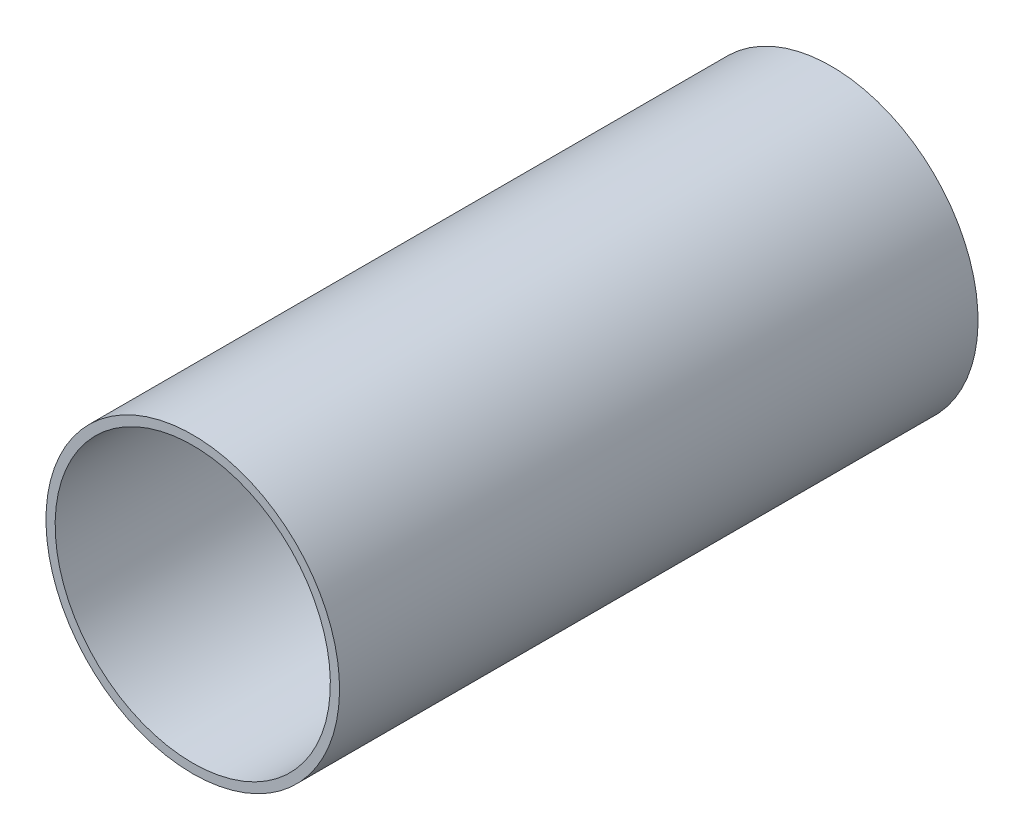
ISO-10303-21;
HEADER;
FILE_DESCRIPTION(('STEP AP214'),'2;1');
FILE_NAME('part.step','',(''),(''),'','','');
FILE_SCHEMA(('AUTOMOTIVE_DESIGN { 1 0 10303 214 1 1 1 1 }'));
ENDSEC;
DATA;
#1=APPLICATION_CONTEXT('core data for automotive mechanical design processes');
#2=APPLICATION_PROTOCOL_DEFINITION('international standard','automotive_design',2000,#1);
#3=PRODUCT_CONTEXT('',#1,'mechanical');
#4=PRODUCT('Part','Part','',(#3));
#5=PRODUCT_RELATED_PRODUCT_CATEGORY('part','',(#4));
#6=PRODUCT_DEFINITION_FORMATION('','',#4);
#7=PRODUCT_DEFINITION_CONTEXT('part definition',#1,'design');
#8=PRODUCT_DEFINITION('design','',#6,#7);
#9=PRODUCT_DEFINITION_SHAPE('','',#8);
#10=(LENGTH_UNIT() NAMED_UNIT(*) SI_UNIT(.MILLI.,.METRE.));
#11=(NAMED_UNIT(*) PLANE_ANGLE_UNIT() SI_UNIT($,.RADIAN.));
#12=(NAMED_UNIT(*) SI_UNIT($,.STERADIAN.) SOLID_ANGLE_UNIT());
#13=UNCERTAINTY_MEASURE_WITH_UNIT(LENGTH_MEASURE(1.E-05),#10,'distance_accuracy_value','');
#14=(GEOMETRIC_REPRESENTATION_CONTEXT(3) GLOBAL_UNCERTAINTY_ASSIGNED_CONTEXT((#13)) GLOBAL_UNIT_ASSIGNED_CONTEXT((#10,
#11,#12)) REPRESENTATION_CONTEXT('',''));
#15=CARTESIAN_POINT('',(0.,0.,0.));
#16=DIRECTION('',(0.,0.,1.));
#17=DIRECTION('',(1.,0.,0.));
#18=AXIS2_PLACEMENT_3D('',#15,#16,#17);
#19=CARTESIAN_POINT('',(173.228,-102.616,-0.045));
#20=DIRECTION('',(0.,0.,-1.));
#21=DIRECTION('',(0.,-1.,0.));
#22=AXIS2_PLACEMENT_3D('',#19,#20,#21);
#23=CYLINDRICAL_SURFACE('',#22,0.375);
#24=CARTESIAN_POINT('',(173.228,-102.616,-0.035));
#25=DIRECTION('',(0.,0.,-1.));
#26=DIRECTION('',(0.,-1.,0.));
#27=AXIS2_PLACEMENT_3D('',#24,#25,#26);
#28=CIRCLE('',#27,0.375);
#29=CARTESIAN_POINT('',(173.228,-102.991,-0.035));
#30=VERTEX_POINT('',#29);
#31=EDGE_CURVE('E20',#30,#30,#28,.T.);
#32=ORIENTED_EDGE('',*,*,#31,.T.);
#33=DIRECTION('',(0.,0.,1.));
#34=VECTOR('',#33,1.);
#35=CARTESIAN_POINT('',(173.228,-102.991,-0.045));
#36=LINE('',#35,#34);
#37=CARTESIAN_POINT('',(173.228,-102.991,1.705));
#38=VERTEX_POINT('',#37);
#39=EDGE_CURVE('E11',#30,#38,#36,.T.);
#40=ORIENTED_EDGE('',*,*,#39,.T.);
#41=CARTESIAN_POINT('',(173.228,-102.616,1.705));
#42=DIRECTION('',(0.,0.,-1.));
#43=DIRECTION('',(0.,-1.,0.));
#44=AXIS2_PLACEMENT_3D('',#41,#42,#43);
#45=CIRCLE('',#44,0.375);
#46=EDGE_CURVE('E26',#38,#38,#45,.T.);
#47=ORIENTED_EDGE('',*,*,#46,.F.);
#48=ORIENTED_EDGE('',*,*,#39,.F.);
#49=EDGE_LOOP('',(#32,#40,#47,#48));
#50=FACE_BOUND('',#49,.T.);
#51=ADVANCED_FACE('F17',(#50),#23,.F.);
#52=CARTESIAN_POINT('',(173.228,-103.016,1.705));
#53=DIRECTION('',(0.,0.,1.));
#54=DIRECTION('',(1.,0.,0.));
#55=AXIS2_PLACEMENT_3D('',#52,#53,#54);
#56=PLANE('',#55);
#57=ORIENTED_EDGE('',*,*,#46,.T.);
#58=EDGE_LOOP('',(#57));
#59=FACE_BOUND('',#58,.T.);
#60=CARTESIAN_POINT('',(173.228,-102.616,1.705));
#61=DIRECTION('',(0.,0.,1.));
#62=DIRECTION('',(0.,-1.,0.));
#63=AXIS2_PLACEMENT_3D('',#60,#61,#62);
#64=CIRCLE('',#63,0.4);
#65=CARTESIAN_POINT('',(173.228,-103.016,1.705));
#66=VERTEX_POINT('',#65);
#67=EDGE_CURVE('E58',#66,#66,#64,.T.);
#68=ORIENTED_EDGE('',*,*,#67,.T.);
#69=EDGE_LOOP('',(#68));
#70=FACE_BOUND('',#69,.T.);
#71=ADVANCED_FACE('F80',(#59,#70),#56,.T.);
#72=CARTESIAN_POINT('',(173.228,-103.016,-0.035));
#73=DIRECTION('',(0.,0.,1.));
#74=DIRECTION('',(1.,0.,0.));
#75=AXIS2_PLACEMENT_3D('',#72,#73,#74);
#76=PLANE('',#75);
#77=ORIENTED_EDGE('',*,*,#31,.F.);
#78=EDGE_LOOP('',(#77));
#79=FACE_BOUND('',#78,.T.);
#80=CARTESIAN_POINT('',(173.228,-102.616,-0.035));
#81=DIRECTION('',(0.,0.,1.));
#82=DIRECTION('',(0.,-1.,0.));
#83=AXIS2_PLACEMENT_3D('',#80,#81,#82);
#84=CIRCLE('',#83,0.4);
#85=CARTESIAN_POINT('',(173.228,-103.016,-0.035));
#86=VERTEX_POINT('',#85);
#87=EDGE_CURVE('E57',#86,#86,#84,.T.);
#88=ORIENTED_EDGE('',*,*,#87,.F.);
#89=EDGE_LOOP('',(#88));
#90=FACE_BOUND('',#89,.T.);
#91=ADVANCED_FACE('F77',(#79,#90),#76,.F.);
#92=CARTESIAN_POINT('',(173.228,-102.616,-0.035));
#93=DIRECTION('',(0.,0.,-1.));
#94=DIRECTION('',(0.,-1.,0.));
#95=AXIS2_PLACEMENT_3D('',#92,#93,#94);
#96=CYLINDRICAL_SURFACE('',#95,0.4);
#97=ORIENTED_EDGE('',*,*,#87,.T.);
#98=DIRECTION('',(0.,0.,1.));
#99=VECTOR('',#98,1.);
#100=CARTESIAN_POINT('',(173.228,-103.016,-0.035));
#101=LINE('',#100,#99);
#102=EDGE_CURVE('E54',#86,#66,#101,.T.);
#103=ORIENTED_EDGE('',*,*,#102,.T.);
#104=ORIENTED_EDGE('',*,*,#67,.F.);
#105=ORIENTED_EDGE('',*,*,#102,.F.);
#106=EDGE_LOOP('',(#97,#103,#104,#105));
#107=FACE_BOUND('',#106,.T.);
#108=ADVANCED_FACE('F55',(#107),#96,.T.);
#109=CLOSED_SHELL('',(#51,#71,#91,#108));
#110=MANIFOLD_SOLID_BREP('B1',#109);
#111=ADVANCED_BREP_SHAPE_REPRESENTATION('',(#18,#110),#14);
#112=SHAPE_DEFINITION_REPRESENTATION(#9,#111);
ENDSEC;
END-ISO-10303-21;
